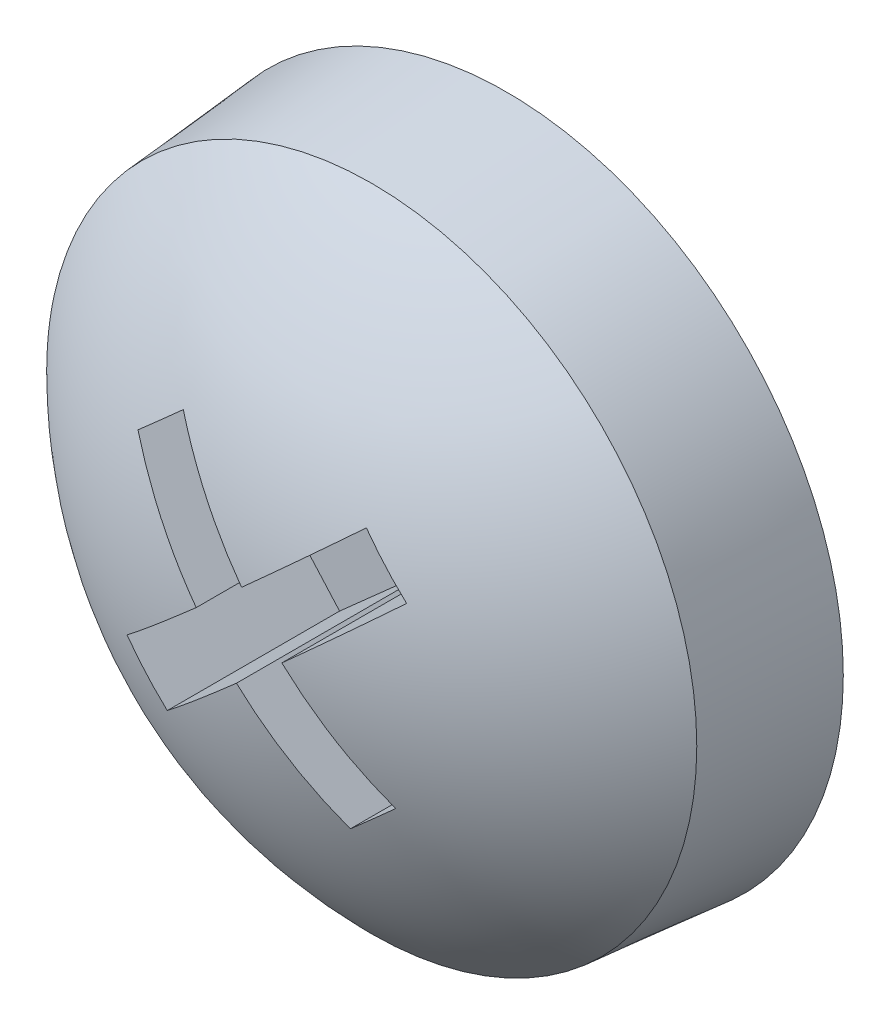
ISO-10303-21;
HEADER;
FILE_DESCRIPTION(('STEP AP214'),'2;1');
FILE_NAME('part.step','',(''),(''),'','','');
FILE_SCHEMA(('AUTOMOTIVE_DESIGN { 1 0 10303 214 1 1 1 1 }'));
ENDSEC;
DATA;
#1=APPLICATION_CONTEXT('core data for automotive mechanical design processes');
#2=APPLICATION_PROTOCOL_DEFINITION('international standard','automotive_design',2000,#1);
#3=PRODUCT_CONTEXT('',#1,'mechanical');
#4=PRODUCT('Part','Part','',(#3));
#5=PRODUCT_RELATED_PRODUCT_CATEGORY('part','',(#4));
#6=PRODUCT_DEFINITION_FORMATION('','',#4);
#7=PRODUCT_DEFINITION_CONTEXT('part definition',#1,'design');
#8=PRODUCT_DEFINITION('design','',#6,#7);
#9=PRODUCT_DEFINITION_SHAPE('','',#8);
#10=(LENGTH_UNIT() NAMED_UNIT(*) SI_UNIT(.MILLI.,.METRE.));
#11=(NAMED_UNIT(*) PLANE_ANGLE_UNIT() SI_UNIT($,.RADIAN.));
#12=(NAMED_UNIT(*) SI_UNIT($,.STERADIAN.) SOLID_ANGLE_UNIT());
#13=UNCERTAINTY_MEASURE_WITH_UNIT(LENGTH_MEASURE(1.E-05),#10,'distance_accuracy_value','');
#14=(GEOMETRIC_REPRESENTATION_CONTEXT(3) GLOBAL_UNCERTAINTY_ASSIGNED_CONTEXT((#13)) GLOBAL_UNIT_ASSIGNED_CONTEXT((#10,
#11,#12)) REPRESENTATION_CONTEXT('',''));
#15=CARTESIAN_POINT('',(0.,0.,0.));
#16=DIRECTION('',(0.,0.,1.));
#17=DIRECTION('',(1.,0.,0.));
#18=AXIS2_PLACEMENT_3D('',#15,#16,#17);
#19=CARTESIAN_POINT('',(-6.90000000000015,4.50499199787339,21.6));
#20=DIRECTION('',(0.,0.,1.));
#21=DIRECTION('',(0.,-1.,0.));
#22=AXIS2_PLACEMENT_3D('',#19,#20,#21);
#23=PLANE('',#22);
#24=DIRECTION('',(0.747876143588401,0.66383828893138,0.));
#25=VECTOR('',#24,1.);
#26=CARTESIAN_POINT('',(-7.0194908920078,4.6396097037193,21.6));
#27=LINE('',#26,#25);
#28=CARTESIAN_POINT('',(-6.88487318616189,4.75910059572695,21.6));
#29=VERTEX_POINT('',#28);
#30=CARTESIAN_POINT('',(-6.30900855559882,5.27025607820411,21.6));
#31=VERTEX_POINT('',#30);
#32=EDGE_CURVE('E84',#29,#31,#27,.T.);
#33=ORIENTED_EDGE('',*,*,#32,.F.);
#34=DIRECTION('',(0.66383828893138,-0.747876143588401,0.));
#35=VECTOR('',#34,1.);
#36=CARTESIAN_POINT('',(-6.76538229415424,4.62448288988104,21.6));
#37=LINE('',#36,#35);
#38=CARTESIAN_POINT('',(-7.39602866863905,5.33496522629002,21.6));
#39=VERTEX_POINT('',#38);
#40=EDGE_CURVE('E89',#39,#29,#37,.T.);
#41=ORIENTED_EDGE('',*,*,#40,.F.);
#42=DIRECTION('',(0.747876143588401,0.66383828893138,0.));
#43=VECTOR('',#42,1.);
#44=CARTESIAN_POINT('',(-7.53064637448496,5.21547433428237,21.6));
#45=LINE('',#44,#43);
#46=CARTESIAN_POINT('',(-7.66526408033088,5.09598344227472,21.6));
#47=VERTEX_POINT('',#46);
#48=EDGE_CURVE('E140',#47,#39,#45,.T.);
#49=ORIENTED_EDGE('',*,*,#48,.F.);
#50=DIRECTION('',(-0.66383828893138,0.747876143588401,0.));
#51=VECTOR('',#50,1.);
#52=CARTESIAN_POINT('',(-7.03461770584607,4.38550110586574,21.6));
#53=LINE('',#52,#51);
#54=CARTESIAN_POINT('',(-7.15410859785371,4.52011881171165,21.6));
#55=VERTEX_POINT('',#54);
#56=EDGE_CURVE('E151',#55,#47,#53,.T.);
#57=ORIENTED_EDGE('',*,*,#56,.F.);
#58=DIRECTION('',(0.747876143588401,0.66383828893138,0.));
#59=VECTOR('',#58,1.);
#60=CARTESIAN_POINT('',(-7.0194908920078,4.6396097037193,21.6));
#61=LINE('',#60,#59);
#62=CARTESIAN_POINT('',(-7.72997322841678,4.00896332923449,21.6));
#63=VERTEX_POINT('',#62);
#64=EDGE_CURVE('E154',#63,#55,#61,.T.);
#65=ORIENTED_EDGE('',*,*,#64,.F.);
#66=DIRECTION('',(-0.66383828893138,0.747876143588401,0.));
#67=VECTOR('',#66,1.);
#68=CARTESIAN_POINT('',(-7.61048233640913,3.87434562338858,21.6));
#69=LINE('',#68,#67);
#70=CARTESIAN_POINT('',(-7.49099144440148,3.73972791754267,21.6));
#71=VERTEX_POINT('',#70);
#72=EDGE_CURVE('E162',#71,#63,#69,.T.);
#73=ORIENTED_EDGE('',*,*,#72,.F.);
#74=DIRECTION('',(-0.747876143588401,-0.66383828893138,0.));
#75=VECTOR('',#74,1.);
#76=CARTESIAN_POINT('',(-6.78050910799251,4.37037429202748,21.6));
#77=LINE('',#76,#75);
#78=CARTESIAN_POINT('',(-6.91512681383842,4.25088340001983,21.6));
#79=VERTEX_POINT('',#78);
#80=EDGE_CURVE('E167',#79,#71,#77,.T.);
#81=ORIENTED_EDGE('',*,*,#80,.F.);
#82=DIRECTION('',(-0.66383828893138,0.747876143588401,0.));
#83=VECTOR('',#82,1.);
#84=CARTESIAN_POINT('',(-7.03461770584607,4.38550110586574,21.6));
#85=LINE('',#84,#83);
#86=CARTESIAN_POINT('',(-6.40397133136126,3.67501876945676,21.6));
#87=VERTEX_POINT('',#86);
#88=EDGE_CURVE('E172',#87,#79,#85,.T.);
#89=ORIENTED_EDGE('',*,*,#88,.F.);
#90=DIRECTION('',(0.747876143588401,0.66383828893138,0.));
#91=VECTOR('',#90,1.);
#92=CARTESIAN_POINT('',(-6.26935362551535,3.79450966146441,21.6));
#93=LINE('',#92,#91);
#94=CARTESIAN_POINT('',(-6.13473591966944,3.91400055347207,21.6));
#95=VERTEX_POINT('',#94);
#96=EDGE_CURVE('E178',#87,#95,#93,.T.);
#97=ORIENTED_EDGE('',*,*,#96,.T.);
#98=DIRECTION('',(0.66383828893138,-0.747876143588401,0.));
#99=VECTOR('',#98,1.);
#100=CARTESIAN_POINT('',(-6.76538229415424,4.62448288988104,21.6));
#101=LINE('',#100,#99);
#102=CARTESIAN_POINT('',(-6.64589140214659,4.48986518403513,21.6));
#103=VERTEX_POINT('',#102);
#104=EDGE_CURVE('E183',#103,#95,#101,.T.);
#105=ORIENTED_EDGE('',*,*,#104,.F.);
#106=DIRECTION('',(-0.747876143588401,-0.66383828893138,0.));
#107=VECTOR('',#106,1.);
#108=CARTESIAN_POINT('',(-6.78050910799251,4.37037429202748,21.6));
#109=LINE('',#108,#107);
#110=CARTESIAN_POINT('',(-6.07002677158353,5.00102066651229,21.6));
#111=VERTEX_POINT('',#110);
#112=EDGE_CURVE('E119',#111,#103,#109,.T.);
#113=ORIENTED_EDGE('',*,*,#112,.F.);
#114=DIRECTION('',(-0.66383828893138,0.747876143588401,0.));
#115=VECTOR('',#114,1.);
#116=CARTESIAN_POINT('',(-6.18951766359117,5.1356383723582,21.6));
#117=LINE('',#116,#115);
#118=EDGE_CURVE('E117',#111,#31,#117,.T.);
#119=ORIENTED_EDGE('',*,*,#118,.T.);
#120=EDGE_LOOP('',(#33,#41,#49,#57,#65,#73,#81,#89,#97,#105,#113,#119));
#121=FACE_BOUND('',#120,.T.);
#122=ADVANCED_FACE('F17',(#121),#23,.T.);
#123=CARTESIAN_POINT('',(-7.0194908920078,4.6396097037193,22.2));
#124=DIRECTION('',(0.66383828893138,-0.747876143588401,0.));
#125=DIRECTION('',(0.747876143588401,0.66383828893138,0.));
#126=AXIS2_PLACEMENT_3D('',#123,#124,#125);
#127=PLANE('',#126);
#128=DIRECTION('',(0.,0.,1.));
#129=VECTOR('',#128,1.);
#130=CARTESIAN_POINT('',(-6.88487318616189,4.75910059572695,22.2));
#131=LINE('',#130,#129);
#132=CARTESIAN_POINT('',(-6.88487318616189,4.75910059572695,22.788097569794));
#133=VERTEX_POINT('',#132);
#134=EDGE_CURVE('E127',#29,#133,#131,.T.);
#135=ORIENTED_EDGE('',*,*,#134,.F.);
#136=ORIENTED_EDGE('',*,*,#32,.T.);
#137=DIRECTION('',(0.,0.,1.));
#138=VECTOR('',#137,1.);
#139=CARTESIAN_POINT('',(-6.30900855559882,5.27025607820411,22.2));
#140=LINE('',#139,#138);
#141=CARTESIAN_POINT('',(-6.30900855559882,5.27025607820411,22.6229045231911));
#142=VERTEX_POINT('',#141);
#143=EDGE_CURVE('E123',#31,#142,#140,.T.);
#144=ORIENTED_EDGE('',*,*,#143,.T.);
#145=CARTESIAN_POINT('',(-6.88487318616189,4.75910059572695,22.788097569794));
#146=CARTESIAN_POINT('',(-6.86018725238199,4.78101260372668,22.7859104299673));
#147=CARTESIAN_POINT('',(-6.83553118762501,4.80289809904616,22.7831210421487));
#148=CARTESIAN_POINT('',(-6.78640820570417,4.84650119635726,22.7763560552392));
#149=CARTESIAN_POINT('',(-6.76194092600565,4.868219120146,22.7723851623111));
#150=CARTESIAN_POINT('',(-6.71319426733734,4.91148818115152,22.7632701136372));
#151=CARTESIAN_POINT('',(-6.68891456403112,4.93303960625946,22.7581290588921));
#152=CARTESIAN_POINT('',(-6.64054218782471,4.97597644242906,22.7466823115268));
#153=CARTESIAN_POINT('',(-6.61644931068595,4.99736203477927,22.7403781619621));
#154=CARTESIAN_POINT('',(-6.56844981562365,5.03996788996652,22.7266089835755));
#155=CARTESIAN_POINT('',(-6.54454319770011,5.06118815280357,22.7191439547536));
#156=CARTESIAN_POINT('',(-6.4969160965814,5.10346345946291,22.703052205587));
#157=CARTESIAN_POINT('',(-6.47319590048996,5.12451824844295,22.6944239659575));
#158=CARTESIAN_POINT('',(-6.42594275839351,5.16646161736153,22.6760004253173));
#159=CARTESIAN_POINT('',(-6.40241046789994,5.1873496154476,22.666202118307));
#160=CARTESIAN_POINT('',(-6.35553505693748,5.22895769838091,22.6454289197685));
#161=CARTESIAN_POINT('',(-6.33219304956501,5.24967679520893,22.6344495373844));
#162=CARTESIAN_POINT('',(-6.30900855559883,5.2702560782041,22.622904523191));
#163=B_SPLINE_CURVE_WITH_KNOTS('',3,(#145,#146,#147,#148,#149,#150,#151,#152,#153,#154,#155,
#156,#157,#158,#159,#160,#161,#162),.UNSPECIFIED.,.F.,.F.,(4,2,2,2,2,2,2,2,4),(0.,
0.0992357442434167,0.198081387639265,0.29666807248049,0.395124892694088,0.493581712907686,
0.592168397748909,0.691014041144758,0.790249785388173),.UNSPECIFIED.);
#164=EDGE_CURVE('E20',#133,#142,#163,.T.);
#165=ORIENTED_EDGE('',*,*,#164,.F.);
#166=EDGE_LOOP('',(#135,#136,#144,#165));
#167=FACE_BOUND('',#166,.T.);
#168=ADVANCED_FACE('F125',(#167),#127,.T.);
#169=CARTESIAN_POINT('',(-6.18951766359117,5.1356383723582,22.2));
#170=DIRECTION('',(0.747876143588401,0.66383828893138,0.));
#171=DIRECTION('',(-0.66383828893138,0.747876143588401,0.));
#172=AXIS2_PLACEMENT_3D('',#169,#170,#171);
#173=PLANE('',#172);
#174=ORIENTED_EDGE('',*,*,#118,.F.);
#175=DIRECTION('',(0.,0.,1.));
#176=VECTOR('',#175,1.);
#177=CARTESIAN_POINT('',(-6.07002677158354,5.00102066651229,22.2));
#178=LINE('',#177,#176);
#179=CARTESIAN_POINT('',(-6.07002677158354,5.00102066651228,22.6229045231911));
#180=VERTEX_POINT('',#179);
#181=EDGE_CURVE('E132',#180,#111,#178,.F.);
#182=ORIENTED_EDGE('',*,*,#181,.F.);
#183=CARTESIAN_POINT('',(-6.30900855559881,5.27025607820411,22.622904523191));
#184=CARTESIAN_POINT('',(-6.26917825826292,5.22538350958884,22.6271329188894));
#185=CARTESIAN_POINT('',(-6.22934796092705,5.18051094097354,22.6292471167385));
#186=CARTESIAN_POINT('',(-6.14968736625535,5.09076580374292,22.6292471167385));
#187=CARTESIAN_POINT('',(-6.10985706891952,5.0458932351276,22.6271329188894));
#188=CARTESIAN_POINT('',(-6.0700267715837,5.00102066651225,22.6229045231911));
#189=B_SPLINE_CURVE_WITH_KNOTS('',3,(#183,#184,#185,#186,#187,#188),.UNSPECIFIED.,.F.,.F.,(4,2,
4),(0.,0.180111711148639,0.36022342229728),.UNSPECIFIED.);
#190=EDGE_CURVE('E131',#142,#180,#189,.T.);
#191=ORIENTED_EDGE('',*,*,#190,.F.);
#192=ORIENTED_EDGE('',*,*,#143,.F.);
#193=EDGE_LOOP('',(#174,#182,#191,#192));
#194=FACE_BOUND('',#193,.T.);
#195=ADVANCED_FACE('F129',(#194),#173,.F.);
#196=CARTESIAN_POINT('',(-6.78050910799251,4.37037429202748,22.2));
#197=DIRECTION('',(-0.66383828893138,0.747876143588401,0.));
#198=DIRECTION('',(-0.747876143588401,-0.66383828893138,0.));
#199=AXIS2_PLACEMENT_3D('',#196,#197,#198);
#200=PLANE('',#199);
#201=DIRECTION('',(0.,0.,1.));
#202=VECTOR('',#201,1.);
#203=CARTESIAN_POINT('',(-6.64589140214659,4.48986518403512,22.2));
#204=LINE('',#203,#202);
#205=CARTESIAN_POINT('',(-6.64589140214659,4.48986518403512,22.788097569794));
#206=VERTEX_POINT('',#205);
#207=EDGE_CURVE('E180',#206,#103,#204,.F.);
#208=ORIENTED_EDGE('',*,*,#207,.F.);
#209=CARTESIAN_POINT('',(-6.07002677158355,5.00102066651227,22.622904523191));
#210=CARTESIAN_POINT('',(-6.09321126554972,4.9804413835171,22.6344495373844));
#211=CARTESIAN_POINT('',(-6.1165532729222,4.95972228668909,22.6454289197685));
#212=CARTESIAN_POINT('',(-6.16342868388465,4.91811420375578,22.666202118307));
#213=CARTESIAN_POINT('',(-6.18696097437822,4.89722620566971,22.6760004253173));
#214=CARTESIAN_POINT('',(-6.23421411647467,4.85528283675113,22.6944239659575));
#215=CARTESIAN_POINT('',(-6.25793431256611,4.83422804777108,22.703052205587));
#216=CARTESIAN_POINT('',(-6.30556141368482,4.79195274111175,22.7191439547536));
#217=CARTESIAN_POINT('',(-6.32946803160836,4.7707324782747,22.7266089835755));
#218=CARTESIAN_POINT('',(-6.37746752667066,4.72812662308745,22.7403781619621));
#219=CARTESIAN_POINT('',(-6.40156040380942,4.70674103073724,22.7466823115268));
#220=CARTESIAN_POINT('',(-6.44993278001583,4.66380419456764,22.7581290588921));
#221=CARTESIAN_POINT('',(-6.47421248332205,4.6422527694597,22.7632701136372));
#222=CARTESIAN_POINT('',(-6.52295914199036,4.59898370845418,22.7723851623111));
#223=CARTESIAN_POINT('',(-6.54742642168888,4.57726578466544,22.7763560552392));
#224=CARTESIAN_POINT('',(-6.59654940360971,4.53366268735435,22.7831210421487));
#225=CARTESIAN_POINT('',(-6.6212054683667,4.51177719203486,22.7859104299673));
#226=CARTESIAN_POINT('',(-6.64589140214659,4.48986518403513,22.788097569794));
#227=B_SPLINE_CURVE_WITH_KNOTS('',3,(#209,#210,#211,#212,#213,#214,#215,#216,#217,#218,#219,
#220,#221,#222,#223,#224,#225,#226),.UNSPECIFIED.,.F.,.F.,(4,2,2,2,2,2,2,2,4),(0.,
0.0992357442434134,0.198081387639264,0.296668072480487,0.395124892694083,0.493581712907679,
0.592168397748903,0.691014041144752,0.790249785388165),.UNSPECIFIED.);
#228=EDGE_CURVE('E296',#180,#206,#227,.T.);
#229=ORIENTED_EDGE('',*,*,#228,.F.);
#230=ORIENTED_EDGE('',*,*,#181,.T.);
#231=ORIENTED_EDGE('',*,*,#112,.T.);
#232=EDGE_LOOP('',(#208,#229,#230,#231));
#233=FACE_BOUND('',#232,.T.);
#234=ADVANCED_FACE('F305',(#233),#200,.T.);
#235=CARTESIAN_POINT('',(-6.76538229415424,4.62448288988104,22.2));
#236=DIRECTION('',(-0.747876143588401,-0.66383828893138,0.));
#237=DIRECTION('',(0.66383828893138,-0.747876143588401,0.));
#238=AXIS2_PLACEMENT_3D('',#235,#236,#237);
#239=PLANE('',#238);
#240=CARTESIAN_POINT('',(-6.64589140214659,4.48986518403512,22.788097569794));
#241=CARTESIAN_POINT('',(-6.62397939414686,4.46517925025523,22.7859104299673));
#242=CARTESIAN_POINT('',(-6.60209389882737,4.44052318549825,22.7831210421487));
#243=CARTESIAN_POINT('',(-6.55849080151628,4.39140020357741,22.7763560552392));
#244=CARTESIAN_POINT('',(-6.53677287772753,4.36693292387889,22.7723851623111));
#245=CARTESIAN_POINT('',(-6.49350381672202,4.31818626521058,22.7632701136372));
#246=CARTESIAN_POINT('',(-6.47195239161407,4.29390656190436,22.7581290588921));
#247=CARTESIAN_POINT('',(-6.42901555544448,4.24553418569795,22.7466823115268));
#248=CARTESIAN_POINT('',(-6.40762996309427,4.22144130855919,22.7403781619621));
#249=CARTESIAN_POINT('',(-6.36502410790701,4.17344181349689,22.7266089835755));
#250=CARTESIAN_POINT('',(-6.34380384506997,4.14953519557335,22.7191439547536));
#251=CARTESIAN_POINT('',(-6.30152853841063,4.10190809445464,22.703052205587));
#252=CARTESIAN_POINT('',(-6.28047374943059,4.0781878983632,22.6944239659575));
#253=CARTESIAN_POINT('',(-6.23853038051201,4.03093475626675,22.6760004253173));
#254=CARTESIAN_POINT('',(-6.21764238242594,4.00740246577318,22.666202118307));
#255=CARTESIAN_POINT('',(-6.17603429949263,3.96052705481073,22.6454289197685));
#256=CARTESIAN_POINT('',(-6.15531520266462,3.93718504743825,22.6344495373844));
#257=CARTESIAN_POINT('',(-6.13473591966944,3.91400055347208,22.622904523191));
#258=B_SPLINE_CURVE_WITH_KNOTS('',3,(#240,#241,#242,#243,#244,#245,#246,#247,#248,#249,#250,
#251,#252,#253,#254,#255,#256,#257),.UNSPECIFIED.,.F.,.F.,(4,2,2,2,2,2,2,2,4),(0.,
0.099235744243414,0.198081387639263,0.296668072480487,0.395124892694085,0.493581712907682,
0.592168397748906,0.691014041144753,0.790249785388168),.UNSPECIFIED.);
#259=CARTESIAN_POINT('',(-6.13473591966943,3.91400055347206,22.6229045231911));
#260=VERTEX_POINT('',#259);
#261=EDGE_CURVE('E289',#206,#260,#258,.T.);
#262=ORIENTED_EDGE('',*,*,#261,.F.);
#263=ORIENTED_EDGE('',*,*,#207,.T.);
#264=ORIENTED_EDGE('',*,*,#104,.T.);
#265=DIRECTION('',(0.,0.,1.));
#266=VECTOR('',#265,1.);
#267=CARTESIAN_POINT('',(-6.13473591966943,3.91400055347206,22.2));
#268=LINE('',#267,#266);
#269=EDGE_CURVE('E175',#95,#260,#268,.T.);
#270=ORIENTED_EDGE('',*,*,#269,.T.);
#271=EDGE_LOOP('',(#262,#263,#264,#270));
#272=FACE_BOUND('',#271,.T.);
#273=ADVANCED_FACE('F302',(#272),#239,.T.);
#274=CARTESIAN_POINT('',(-6.26935362551535,3.79450966146441,22.2));
#275=DIRECTION('',(0.66383828893138,-0.747876143588401,0.));
#276=DIRECTION('',(0.747876143588401,0.66383828893138,0.));
#277=AXIS2_PLACEMENT_3D('',#274,#275,#276);
#278=PLANE('',#277);
#279=ORIENTED_EDGE('',*,*,#96,.F.);
#280=DIRECTION('',(0.,0.,1.));
#281=VECTOR('',#280,1.);
#282=CARTESIAN_POINT('',(-6.40397133136126,3.67501876945676,22.2));
#283=LINE('',#282,#281);
#284=CARTESIAN_POINT('',(-6.40397133136127,3.67501876945677,22.6229045231911));
#285=VERTEX_POINT('',#284);
#286=EDGE_CURVE('E174',#285,#87,#283,.F.);
#287=ORIENTED_EDGE('',*,*,#286,.F.);
#288=CARTESIAN_POINT('',(-6.13473591966944,3.91400055347206,22.622904523191));
#289=CARTESIAN_POINT('',(-6.17960848828474,3.87417025613618,22.6271329188894));
#290=CARTESIAN_POINT('',(-6.22448105690004,3.8343399588003,22.6292471167385));
#291=CARTESIAN_POINT('',(-6.31422619413065,3.75467936412853,22.6292471167385));
#292=CARTESIAN_POINT('',(-6.35909876274595,3.71484906679265,22.6271329188894));
#293=CARTESIAN_POINT('',(-6.40397133136126,3.67501876945676,22.622904523191));
#294=B_SPLINE_CURVE_WITH_KNOTS('',3,(#288,#289,#290,#291,#292,#293),.UNSPECIFIED.,.F.,.F.,(4,2,
4),(0.,0.180111711148687,0.360223422297375),.UNSPECIFIED.);
#295=EDGE_CURVE('E282',#260,#285,#294,.T.);
#296=ORIENTED_EDGE('',*,*,#295,.F.);
#297=ORIENTED_EDGE('',*,*,#269,.F.);
#298=EDGE_LOOP('',(#279,#287,#296,#297));
#299=FACE_BOUND('',#298,.T.);
#300=ADVANCED_FACE('F271',(#299),#278,.F.);
#301=CARTESIAN_POINT('',(-7.03461770584607,4.38550110586574,22.2));
#302=DIRECTION('',(0.747876143588401,0.66383828893138,0.));
#303=DIRECTION('',(-0.66383828893138,0.747876143588401,0.));
#304=AXIS2_PLACEMENT_3D('',#301,#302,#303);
#305=PLANE('',#304);
#306=CARTESIAN_POINT('',(-6.40397133136128,3.67501876945678,22.622904523191));
#307=CARTESIAN_POINT('',(-6.42455061435645,3.69820326342295,22.6344495373844));
#308=CARTESIAN_POINT('',(-6.44526971118446,3.72154527079543,22.6454289197685));
#309=CARTESIAN_POINT('',(-6.48687779411777,3.76842068175788,22.666202118307));
#310=CARTESIAN_POINT('',(-6.50776579220384,3.79195297225145,22.6760004253173));
#311=CARTESIAN_POINT('',(-6.54970916112242,3.8392061143479,22.6944239659575));
#312=CARTESIAN_POINT('',(-6.57076395010247,3.86292631043935,22.703052205587));
#313=CARTESIAN_POINT('',(-6.6130392567618,3.91055341155805,22.7191439547536));
#314=CARTESIAN_POINT('',(-6.63425951959885,3.93446002948159,22.7266089835755));
#315=CARTESIAN_POINT('',(-6.6768653747861,3.9824595245439,22.7403781619621));
#316=CARTESIAN_POINT('',(-6.69825096713631,4.00655240168266,22.7466823115268));
#317=CARTESIAN_POINT('',(-6.74118780330591,4.05492477788906,22.7581290588921));
#318=CARTESIAN_POINT('',(-6.76273922841385,4.07920448119528,22.7632701136372));
#319=CARTESIAN_POINT('',(-6.80600828941937,4.1279511398636,22.7723851623111));
#320=CARTESIAN_POINT('',(-6.82772621320811,4.15241841956212,22.7763560552392));
#321=CARTESIAN_POINT('',(-6.87132931051921,4.20154140148295,22.7831210421487));
#322=CARTESIAN_POINT('',(-6.89321480583869,4.22619746623993,22.7859104299673));
#323=CARTESIAN_POINT('',(-6.91512681383842,4.25088340001983,22.788097569794));
#324=B_SPLINE_CURVE_WITH_KNOTS('',3,(#306,#307,#308,#309,#310,#311,#312,#313,#314,#315,#316,
#317,#318,#319,#320,#321,#322,#323),.UNSPECIFIED.,.F.,.F.,(4,2,2,2,2,2,2,2,4),(0.,
0.0992357442434151,0.198081387639265,0.296668072480488,0.395124892694087,0.493581712907684,
0.592168397748908,0.691014041144757,0.790249785388173),.UNSPECIFIED.);
#325=CARTESIAN_POINT('',(-6.91512681383842,4.25088340001983,22.788097569794));
#326=VERTEX_POINT('',#325);
#327=EDGE_CURVE('E275',#285,#326,#324,.T.);
#328=ORIENTED_EDGE('',*,*,#327,.F.);
#329=ORIENTED_EDGE('',*,*,#286,.T.);
#330=ORIENTED_EDGE('',*,*,#88,.T.);
#331=DIRECTION('',(0.,0.,1.));
#332=VECTOR('',#331,1.);
#333=CARTESIAN_POINT('',(-6.91512681383842,4.25088340001983,22.2));
#334=LINE('',#333,#332);
#335=EDGE_CURVE('E169',#326,#79,#334,.F.);
#336=ORIENTED_EDGE('',*,*,#335,.F.);
#337=EDGE_LOOP('',(#328,#329,#330,#336));
#338=FACE_BOUND('',#337,.T.);
#339=ADVANCED_FACE('F266',(#338),#305,.T.);
#340=CARTESIAN_POINT('',(-6.78050910799251,4.37037429202748,22.2));
#341=DIRECTION('',(-0.66383828893138,0.747876143588401,0.));
#342=DIRECTION('',(-0.747876143588401,-0.66383828893138,0.));
#343=AXIS2_PLACEMENT_3D('',#340,#341,#342);
#344=PLANE('',#343);
#345=ORIENTED_EDGE('',*,*,#335,.T.);
#346=ORIENTED_EDGE('',*,*,#80,.T.);
#347=DIRECTION('',(0.,0.,1.));
#348=VECTOR('',#347,1.);
#349=CARTESIAN_POINT('',(-7.49099144440148,3.73972791754267,22.2));
#350=LINE('',#349,#348);
#351=CARTESIAN_POINT('',(-7.49099144440148,3.73972791754267,22.6229045231911));
#352=VERTEX_POINT('',#351);
#353=EDGE_CURVE('E164',#352,#71,#350,.F.);
#354=ORIENTED_EDGE('',*,*,#353,.F.);
#355=CARTESIAN_POINT('',(-6.91512681383842,4.25088340001983,22.788097569794));
#356=CARTESIAN_POINT('',(-6.93981274761832,4.2289713920201,22.7859104299673));
#357=CARTESIAN_POINT('',(-6.9644688123753,4.20708589670062,22.7831210421487));
#358=CARTESIAN_POINT('',(-7.01359179429613,4.16348279938952,22.7763560552392));
#359=CARTESIAN_POINT('',(-7.03805907399465,4.14176487560078,22.7723851623111));
#360=CARTESIAN_POINT('',(-7.08680573266296,4.09849581459526,22.7632701136372));
#361=CARTESIAN_POINT('',(-7.11108543596919,4.07694438948732,22.7581290588921));
#362=CARTESIAN_POINT('',(-7.15945781217559,4.03400755331772,22.7466823115268));
#363=CARTESIAN_POINT('',(-7.18355068931435,4.01262196096751,22.7403781619621));
#364=CARTESIAN_POINT('',(-7.23155018437665,3.97001610578026,22.7266089835755));
#365=CARTESIAN_POINT('',(-7.2554568023002,3.94879584294321,22.7191439547536));
#366=CARTESIAN_POINT('',(-7.3030839034189,3.90652053628388,22.703052205587));
#367=CARTESIAN_POINT('',(-7.32680409951035,3.88546574730383,22.6944239659575));
#368=CARTESIAN_POINT('',(-7.37405724160679,3.84352237838525,22.6760004253173));
#369=CARTESIAN_POINT('',(-7.39758953210037,3.82263438029918,22.666202118307));
#370=CARTESIAN_POINT('',(-7.44446494306282,3.78102629736587,22.6454289197685));
#371=CARTESIAN_POINT('',(-7.4678069504353,3.76030720053786,22.6344495373844));
#372=CARTESIAN_POINT('',(-7.49099144440147,3.73972791754269,22.622904523191));
#373=B_SPLINE_CURVE_WITH_KNOTS('',3,(#355,#356,#357,#358,#359,#360,#361,#362,#363,#364,#365,
#366,#367,#368,#369,#370,#371,#372),.UNSPECIFIED.,.F.,.F.,(4,2,2,2,2,2,2,2,4),(0.,
0.0992357442434139,0.198081387639264,0.296668072480486,0.395124892694083,0.493581712907681,
0.592168397748904,0.691014041144752,0.790249785388166),.UNSPECIFIED.);
#374=EDGE_CURVE('E251',#326,#352,#373,.T.);
#375=ORIENTED_EDGE('',*,*,#374,.F.);
#376=EDGE_LOOP('',(#345,#346,#354,#375));
#377=FACE_BOUND('',#376,.T.);
#378=ADVANCED_FACE('F261',(#377),#344,.T.);
#379=CARTESIAN_POINT('',(-7.61048233640913,3.87434562338858,22.2));
#380=DIRECTION('',(0.747876143588401,0.66383828893138,0.));
#381=DIRECTION('',(-0.66383828893138,0.747876143588401,0.));
#382=AXIS2_PLACEMENT_3D('',#379,#380,#381);
#383=PLANE('',#382);
#384=ORIENTED_EDGE('',*,*,#353,.T.);
#385=ORIENTED_EDGE('',*,*,#72,.T.);
#386=DIRECTION('',(0.,0.,1.));
#387=VECTOR('',#386,1.);
#388=CARTESIAN_POINT('',(-7.72997322841678,4.00896332923449,22.2));
#389=LINE('',#388,#387);
#390=CARTESIAN_POINT('',(-7.72997322841677,4.0089633292345,22.6229045231911));
#391=VERTEX_POINT('',#390);
#392=EDGE_CURVE('E159',#391,#63,#389,.F.);
#393=ORIENTED_EDGE('',*,*,#392,.F.);
#394=CARTESIAN_POINT('',(-7.49099144440149,3.73972791754267,22.622904523191));
#395=CARTESIAN_POINT('',(-7.53082174173737,3.78460048615798,22.6271329188894));
#396=CARTESIAN_POINT('',(-7.57065203907325,3.82947305477328,22.6292471167385));
#397=CARTESIAN_POINT('',(-7.65031263374502,3.91921819200389,22.6292471167385));
#398=CARTESIAN_POINT('',(-7.6901429310809,3.9640907606192,22.6271329188894));
#399=CARTESIAN_POINT('',(-7.72997322841678,4.0089633292345,22.622904523191));
#400=B_SPLINE_CURVE_WITH_KNOTS('',3,(#394,#395,#396,#397,#398,#399),.UNSPECIFIED.,.F.,.F.,(4,2,
4),(0.,0.180111711148691,0.360223422297381),.UNSPECIFIED.);
#401=EDGE_CURVE('E244',#352,#391,#400,.T.);
#402=ORIENTED_EDGE('',*,*,#401,.F.);
#403=EDGE_LOOP('',(#384,#385,#393,#402));
#404=FACE_BOUND('',#403,.T.);
#405=ADVANCED_FACE('F258',(#404),#383,.T.);
#406=CARTESIAN_POINT('',(-7.0194908920078,4.6396097037193,22.2));
#407=DIRECTION('',(0.66383828893138,-0.747876143588401,0.));
#408=DIRECTION('',(0.747876143588401,0.66383828893138,0.));
#409=AXIS2_PLACEMENT_3D('',#406,#407,#408);
#410=PLANE('',#409);
#411=DIRECTION('',(0.,0.,1.));
#412=VECTOR('',#411,1.);
#413=CARTESIAN_POINT('',(-7.15410859785371,4.52011881171165,22.2));
#414=LINE('',#413,#412);
#415=CARTESIAN_POINT('',(-7.15410859785371,4.52011881171165,22.788097569794));
#416=VERTEX_POINT('',#415);
#417=EDGE_CURVE('E143',#416,#55,#414,.F.);
#418=ORIENTED_EDGE('',*,*,#417,.F.);
#419=CARTESIAN_POINT('',(-7.72997322841676,4.0089633292345,22.622904523191));
#420=CARTESIAN_POINT('',(-7.70678873445059,4.02954261222967,22.6344495373844));
#421=CARTESIAN_POINT('',(-7.68344672707811,4.05026170905769,22.6454289197685));
#422=CARTESIAN_POINT('',(-7.63657131611566,4.091869791991,22.666202118307));
#423=CARTESIAN_POINT('',(-7.61303902562209,4.11275779007706,22.6760004253173));
#424=CARTESIAN_POINT('',(-7.56578588352564,4.15470115899565,22.6944239659575));
#425=CARTESIAN_POINT('',(-7.5420656874342,4.17575594797569,22.703052205587));
#426=CARTESIAN_POINT('',(-7.49443858631549,4.21803125463503,22.7191439547536));
#427=CARTESIAN_POINT('',(-7.47053196839195,4.23925151747207,22.7266089835755));
#428=CARTESIAN_POINT('',(-7.42253247332964,4.28185737265933,22.740378161962));
#429=CARTESIAN_POINT('',(-7.39843959619089,4.30324296500954,22.7466823115268));
#430=CARTESIAN_POINT('',(-7.35006721998448,4.34617980117913,22.7581290588921));
#431=CARTESIAN_POINT('',(-7.32578751667826,4.36773122628708,22.7632701136372));
#432=CARTESIAN_POINT('',(-7.27704085800994,4.4110002872926,22.7723851623111));
#433=CARTESIAN_POINT('',(-7.25257357831142,4.43271821108134,22.7763560552392));
#434=CARTESIAN_POINT('',(-7.20345059639059,4.47632130839243,22.7831210421487));
#435=CARTESIAN_POINT('',(-7.17879453163361,4.49820680371192,22.7859104299673));
#436=CARTESIAN_POINT('',(-7.15410859785371,4.52011881171165,22.788097569794));
#437=B_SPLINE_CURVE_WITH_KNOTS('',3,(#419,#420,#421,#422,#423,#424,#425,#426,#427,#428,#429,
#430,#431,#432,#433,#434,#435,#436),.UNSPECIFIED.,.F.,.F.,(4,2,2,2,2,2,2,2,4),(0.,
0.0992357442434134,0.198081387639263,0.296668072480487,0.395124892694085,0.493581712907682,
0.592168397748906,0.691014041144756,0.79024978538817),.UNSPECIFIED.);
#438=EDGE_CURVE('E237',#391,#416,#437,.T.);
#439=ORIENTED_EDGE('',*,*,#438,.F.);
#440=ORIENTED_EDGE('',*,*,#392,.T.);
#441=ORIENTED_EDGE('',*,*,#64,.T.);
#442=EDGE_LOOP('',(#418,#439,#440,#441));
#443=FACE_BOUND('',#442,.T.);
#444=ADVANCED_FACE('F226',(#443),#410,.T.);
#445=CARTESIAN_POINT('',(-7.03461770584607,4.38550110586574,22.2));
#446=DIRECTION('',(0.747876143588401,0.66383828893138,0.));
#447=DIRECTION('',(-0.66383828893138,0.747876143588401,0.));
#448=AXIS2_PLACEMENT_3D('',#445,#446,#447);
#449=PLANE('',#448);
#450=CARTESIAN_POINT('',(-7.15410859785372,4.52011881171165,22.788097569794));
#451=CARTESIAN_POINT('',(-7.17602060585345,4.54480474549154,22.7859104299673));
#452=CARTESIAN_POINT('',(-7.19790610117293,4.56946081024852,22.7831210421487));
#453=CARTESIAN_POINT('',(-7.24150919848403,4.61858379216936,22.7763560552392));
#454=CARTESIAN_POINT('',(-7.26322712227277,4.64305107186788,22.7723851623111));
#455=CARTESIAN_POINT('',(-7.30649618327828,4.69179773053619,22.7632701136372));
#456=CARTESIAN_POINT('',(-7.32804760838623,4.71607743384241,22.7581290588921));
#457=CARTESIAN_POINT('',(-7.37098444455583,4.76444981004882,22.7466823115268));
#458=CARTESIAN_POINT('',(-7.39237003690603,4.78854268718758,22.7403781619621));
#459=CARTESIAN_POINT('',(-7.43497589209329,4.83654218224988,22.7266089835755));
#460=CARTESIAN_POINT('',(-7.45619615493033,4.86044880017342,22.7191439547536));
#461=CARTESIAN_POINT('',(-7.49847146158967,4.90807590129213,22.703052205587));
#462=CARTESIAN_POINT('',(-7.51952625056971,4.93179609738358,22.6944239659575));
#463=CARTESIAN_POINT('',(-7.5614696194883,4.97904923948002,22.6760004253173));
#464=CARTESIAN_POINT('',(-7.58235761757437,5.00258152997359,22.666202118307));
#465=CARTESIAN_POINT('',(-7.62396570050767,5.04945694093604,22.6454289197685));
#466=CARTESIAN_POINT('',(-7.64468479733569,5.07279894830852,22.6344495373844));
#467=CARTESIAN_POINT('',(-7.66526408033086,5.09598344227469,22.622904523191));
#468=B_SPLINE_CURVE_WITH_KNOTS('',3,(#450,#451,#452,#453,#454,#455,#456,#457,#458,#459,#460,
#461,#462,#463,#464,#465,#466,#467),.UNSPECIFIED.,.F.,.F.,(4,2,2,2,2,2,2,2,4),(0.,
0.0992357442434141,0.198081387639263,0.296668072480487,0.395124892694084,0.493581712907681,
0.592168397748906,0.691014041144753,0.790249785388168),.UNSPECIFIED.);
#469=CARTESIAN_POINT('',(-7.66526408033087,5.09598344227472,22.6229045231911));
#470=VERTEX_POINT('',#469);
#471=EDGE_CURVE('E230',#416,#470,#468,.T.);
#472=ORIENTED_EDGE('',*,*,#471,.F.);
#473=ORIENTED_EDGE('',*,*,#417,.T.);
#474=ORIENTED_EDGE('',*,*,#56,.T.);
#475=DIRECTION('',(0.,0.,1.));
#476=VECTOR('',#475,1.);
#477=CARTESIAN_POINT('',(-7.66526408033087,5.09598344227472,22.2));
#478=LINE('',#477,#476);
#479=EDGE_CURVE('E142',#470,#47,#478,.F.);
#480=ORIENTED_EDGE('',*,*,#479,.F.);
#481=EDGE_LOOP('',(#472,#473,#474,#480));
#482=FACE_BOUND('',#481,.T.);
#483=ADVANCED_FACE('F222',(#482),#449,.T.);
#484=CARTESIAN_POINT('',(-7.53064637448496,5.21547433428237,22.2));
#485=DIRECTION('',(0.66383828893138,-0.747876143588401,0.));
#486=DIRECTION('',(0.747876143588401,0.66383828893138,0.));
#487=AXIS2_PLACEMENT_3D('',#484,#485,#486);
#488=PLANE('',#487);
#489=CARTESIAN_POINT('',(-7.66526408033087,5.09598344227473,22.622904523191));
#490=CARTESIAN_POINT('',(-7.62039151171557,5.13581373961061,22.6271329188894));
#491=CARTESIAN_POINT('',(-7.57551894310026,5.17564403694649,22.6292471167385));
#492=CARTESIAN_POINT('',(-7.48577380586966,5.25530463161825,22.6292471167385));
#493=CARTESIAN_POINT('',(-7.44090123725435,5.29513492895413,22.6271329188894));
#494=CARTESIAN_POINT('',(-7.39602866863905,5.33496522629001,22.622904523191));
#495=B_SPLINE_CURVE_WITH_KNOTS('',3,(#489,#490,#491,#492,#493,#494),.UNSPECIFIED.,.F.,.F.,(4,2,
4),(0.,0.180111711148684,0.360223422297369),.UNSPECIFIED.);
#496=CARTESIAN_POINT('',(-7.39602866863904,5.33496522629001,22.6229045231911));
#497=VERTEX_POINT('',#496);
#498=EDGE_CURVE('E203',#470,#497,#495,.T.);
#499=ORIENTED_EDGE('',*,*,#498,.F.);
#500=ORIENTED_EDGE('',*,*,#479,.T.);
#501=ORIENTED_EDGE('',*,*,#48,.T.);
#502=DIRECTION('',(0.,0.,1.));
#503=VECTOR('',#502,1.);
#504=CARTESIAN_POINT('',(-7.39602866863905,5.33496522629002,22.2));
#505=LINE('',#504,#503);
#506=EDGE_CURVE('E40',#497,#39,#505,.F.);
#507=ORIENTED_EDGE('',*,*,#506,.F.);
#508=EDGE_LOOP('',(#499,#500,#501,#507));
#509=FACE_BOUND('',#508,.T.);
#510=ADVANCED_FACE('F217',(#509),#488,.T.);
#511=CARTESIAN_POINT('',(-6.76538229415424,4.62448288988104,22.2));
#512=DIRECTION('',(-0.747876143588401,-0.66383828893138,0.));
#513=DIRECTION('',(0.66383828893138,-0.747876143588401,0.));
#514=AXIS2_PLACEMENT_3D('',#511,#512,#513);
#515=PLANE('',#514);
#516=CARTESIAN_POINT('',(-7.39602866863904,5.33496522629,22.622904523191));
#517=CARTESIAN_POINT('',(-7.37544938564386,5.31178073232383,22.6344495373844));
#518=CARTESIAN_POINT('',(-7.35473028881585,5.28843872495135,22.6454289197685));
#519=CARTESIAN_POINT('',(-7.31312220588254,5.2415633139889,22.666202118307));
#520=CARTESIAN_POINT('',(-7.29223420779647,5.21803102349533,22.6760004253173));
#521=CARTESIAN_POINT('',(-7.25029083887789,5.17077788139888,22.6944239659575));
#522=CARTESIAN_POINT('',(-7.22923604989785,5.14705768530744,22.703052205587));
#523=CARTESIAN_POINT('',(-7.18696074323851,5.09943058418873,22.7191439547536));
#524=CARTESIAN_POINT('',(-7.16574048040146,5.07552396626519,22.7266089835755));
#525=CARTESIAN_POINT('',(-7.12313462521421,5.02752447120289,22.7403781619621));
#526=CARTESIAN_POINT('',(-7.101749032864,5.00343159406413,22.7466823115268));
#527=CARTESIAN_POINT('',(-7.0588121966944,4.95505921785772,22.7581290588921));
#528=CARTESIAN_POINT('',(-7.03726077158646,4.9307795145515,22.7632701136372));
#529=CARTESIAN_POINT('',(-6.99399171058094,4.88203285588318,22.7723851623111));
#530=CARTESIAN_POINT('',(-6.9722737867922,4.85756557618466,22.7763560552392));
#531=CARTESIAN_POINT('',(-6.92867068948111,4.80844259426383,22.7831210421487));
#532=CARTESIAN_POINT('',(-6.90678519416162,4.78378652950685,22.7859104299673));
#533=CARTESIAN_POINT('',(-6.88487318616189,4.75910059572695,22.788097569794));
#534=B_SPLINE_CURVE_WITH_KNOTS('',3,(#516,#517,#518,#519,#520,#521,#522,#523,#524,#525,#526,
#527,#528,#529,#530,#531,#532,#533),.UNSPECIFIED.,.F.,.F.,(4,2,2,2,2,2,2,2,4),(0.,
0.0992357442434146,0.198081387639264,0.296668072480487,0.395124892694086,0.493581712907684,
0.592168397748908,0.691014041144756,0.790249785388172),.UNSPECIFIED.);
#535=EDGE_CURVE('E195',#497,#133,#534,.T.);
#536=ORIENTED_EDGE('',*,*,#535,.F.);
#537=ORIENTED_EDGE('',*,*,#506,.T.);
#538=ORIENTED_EDGE('',*,*,#40,.T.);
#539=ORIENTED_EDGE('',*,*,#134,.T.);
#540=EDGE_LOOP('',(#536,#537,#538,#539));
#541=FACE_BOUND('',#540,.T.);
#542=ADVANCED_FACE('F214',(#541),#515,.T.);
#543=CARTESIAN_POINT('',(-6.90000000000015,4.5049919978734,20.0719156205536));
#544=DIRECTION('',(0.97116300289575,0.226506981523082,-0.0744110820228584));
#545=DIRECTION('',(0.,-0.312105436206394,-0.950047470756286));
#546=AXIS2_PLACEMENT_3D('',#543,#544,#545);
#547=SPHERICAL_SURFACE('',#546,2.72808437944638);
#548=ORIENTED_EDGE('',*,*,#498,.T.);
#549=ORIENTED_EDGE('',*,*,#535,.T.);
#550=ORIENTED_EDGE('',*,*,#164,.T.);
#551=ORIENTED_EDGE('',*,*,#190,.T.);
#552=ORIENTED_EDGE('',*,*,#228,.T.);
#553=ORIENTED_EDGE('',*,*,#261,.T.);
#554=ORIENTED_EDGE('',*,*,#295,.T.);
#555=ORIENTED_EDGE('',*,*,#327,.T.);
#556=ORIENTED_EDGE('',*,*,#374,.T.);
#557=ORIENTED_EDGE('',*,*,#401,.T.);
#558=ORIENTED_EDGE('',*,*,#438,.T.);
#559=ORIENTED_EDGE('',*,*,#471,.T.);
#560=EDGE_LOOP('',(#548,#549,#550,#551,#552,#553,#554,#555,#556,#557,#558,#559));
#561=FACE_BOUND('',#560,.T.);
#562=CARTESIAN_POINT('',(-6.90000000000015,4.50499199787339,21.9999999999914));
#563=DIRECTION('',(0.,0.,-1.));
#564=DIRECTION('',(-1.,0.,0.));
#565=AXIS2_PLACEMENT_3D('',#562,#563,#564);
#566=CIRCLE('',#565,1.93000906918058);
#567=CARTESIAN_POINT('',(-8.83000906918073,4.50499199787339,21.9999999999914));
#568=VERTEX_POINT('',#567);
#569=EDGE_CURVE('E31',#568,#568,#566,.T.);
#570=ORIENTED_EDGE('',*,*,#569,.F.);
#571=EDGE_LOOP('',(#570));
#572=FACE_BOUND('',#571,.T.);
#573=ADVANCED_FACE('F210',(#561,#572),#547,.T.);
#574=CARTESIAN_POINT('',(-6.90000000000015,4.50499199787339,21.2000000000216));
#575=DIRECTION('',(0.,0.,-1.));
#576=DIRECTION('',(-1.,0.,0.));
#577=AXIS2_PLACEMENT_3D('',#574,#575,#576);
#578=CONICAL_SURFACE('',#577,2.00000000000056,0.0872664626020621);
#579=ORIENTED_EDGE('',*,*,#569,.T.);
#580=EDGE_LOOP('',(#579));
#581=FACE_BOUND('',#580,.T.);
#582=CARTESIAN_POINT('',(-6.90000000000015,4.50499199787339,21.1999999999648));
#583=DIRECTION('',(0.,0.,-1.));
#584=DIRECTION('',(-1.,0.,0.));
#585=AXIS2_PLACEMENT_3D('',#582,#583,#584);
#586=CIRCLE('',#585,2.00000000000553);
#587=CARTESIAN_POINT('',(-8.90000000000568,4.50499199787339,21.1999999999648));
#588=VERTEX_POINT('',#587);
#589=EDGE_CURVE('E11',#588,#588,#586,.T.);
#590=ORIENTED_EDGE('',*,*,#589,.F.);
#591=EDGE_LOOP('',(#590));
#592=FACE_BOUND('',#591,.T.);
#593=ADVANCED_FACE('F382',(#581,#592),#578,.T.);
#594=CARTESIAN_POINT('',(-6.15212385641176,5.16883028680477,21.2));
#595=DIRECTION('',(0.,0.,-1.));
#596=DIRECTION('',(0.,1.,0.));
#597=AXIS2_PLACEMENT_3D('',#594,#595,#596);
#598=PLANE('',#597);
#599=ORIENTED_EDGE('',*,*,#589,.T.);
#600=EDGE_LOOP('',(#599));
#601=FACE_BOUND('',#600,.T.);
#602=ADVANCED_FACE('F380',(#601),#598,.T.);
#603=CLOSED_SHELL('',(#122,#168,#195,#234,#273,#300,#339,#378,#405,#444,#483,#510,#542,#573,
#593,#602));
#604=MANIFOLD_SOLID_BREP('B1',#603);
#605=ADVANCED_BREP_SHAPE_REPRESENTATION('',(#18,#604),#14);
#606=SHAPE_DEFINITION_REPRESENTATION(#9,#605);
ENDSEC;
END-ISO-10303-21;
